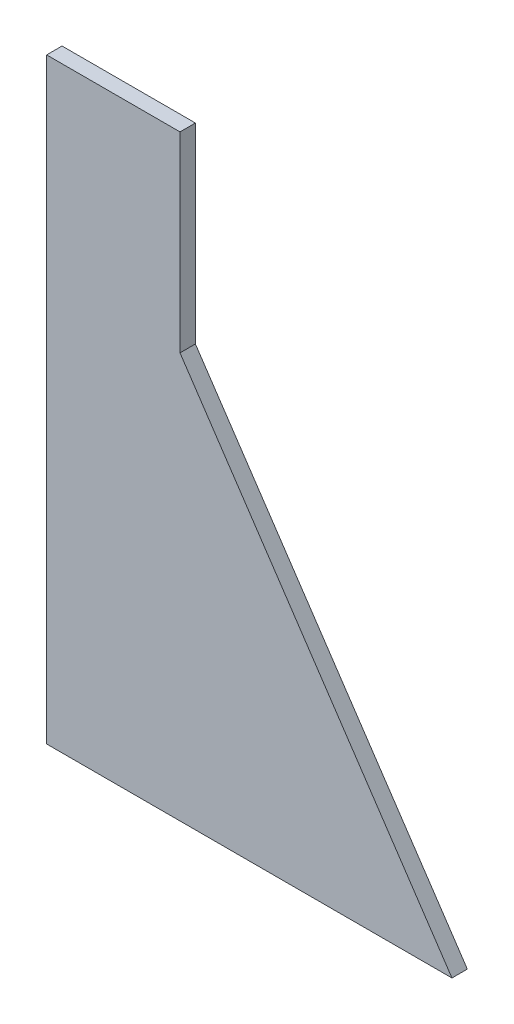
ISO-10303-21;
HEADER;
FILE_DESCRIPTION(('STEP AP214'),'2;1');
FILE_NAME('part.step','',(''),(''),'','','');
FILE_SCHEMA(('AUTOMOTIVE_DESIGN { 1 0 10303 214 1 1 1 1 }'));
ENDSEC;
DATA;
#1=APPLICATION_CONTEXT('core data for automotive mechanical design processes');
#2=APPLICATION_PROTOCOL_DEFINITION('international standard','automotive_design',2000,#1);
#3=PRODUCT_CONTEXT('',#1,'mechanical');
#4=PRODUCT('Part','Part','',(#3));
#5=PRODUCT_RELATED_PRODUCT_CATEGORY('part','',(#4));
#6=PRODUCT_DEFINITION_FORMATION('','',#4);
#7=PRODUCT_DEFINITION_CONTEXT('part definition',#1,'design');
#8=PRODUCT_DEFINITION('design','',#6,#7);
#9=PRODUCT_DEFINITION_SHAPE('','',#8);
#10=(LENGTH_UNIT() NAMED_UNIT(*) SI_UNIT(.MILLI.,.METRE.));
#11=(NAMED_UNIT(*) PLANE_ANGLE_UNIT() SI_UNIT($,.RADIAN.));
#12=(NAMED_UNIT(*) SI_UNIT($,.STERADIAN.) SOLID_ANGLE_UNIT());
#13=UNCERTAINTY_MEASURE_WITH_UNIT(LENGTH_MEASURE(1.E-05),#10,'distance_accuracy_value','');
#14=(GEOMETRIC_REPRESENTATION_CONTEXT(3) GLOBAL_UNCERTAINTY_ASSIGNED_CONTEXT((#13)) GLOBAL_UNIT_ASSIGNED_CONTEXT((#10,
#11,#12)) REPRESENTATION_CONTEXT('',''));
#15=CARTESIAN_POINT('',(0.,0.,0.));
#16=DIRECTION('',(0.,0.,1.));
#17=DIRECTION('',(1.,0.,0.));
#18=AXIS2_PLACEMENT_3D('',#15,#16,#17);
#19=CARTESIAN_POINT('',(0.,0.,-234.833966152866));
#20=DIRECTION('',(0.,1.,0.));
#21=DIRECTION('',(0.,0.,1.));
#22=AXIS2_PLACEMENT_3D('',#19,#20,#21);
#23=PLANE('',#22);
#24=DIRECTION('',(-1.,0.,0.));
#25=VECTOR('',#24,1.);
#26=CARTESIAN_POINT('',(0.,0.,-231.833966152866));
#27=LINE('',#26,#25);
#28=CARTESIAN_POINT('',(26.0000000000001,0.,-231.833966152866));
#29=VERTEX_POINT('',#28);
#30=CARTESIAN_POINT('',(0.,0.,-231.833966152866));
#31=VERTEX_POINT('',#30);
#32=EDGE_CURVE('E110',#29,#31,#27,.T.);
#33=ORIENTED_EDGE('',*,*,#32,.F.);
#34=DIRECTION('',(0.,0.,1.));
#35=VECTOR('',#34,1.);
#36=CARTESIAN_POINT('',(26.0000000000001,0.,-234.833966152866));
#37=LINE('',#36,#35);
#38=CARTESIAN_POINT('',(26.0000000000001,0.,-234.833966152866));
#39=VERTEX_POINT('',#38);
#40=EDGE_CURVE('E11',#39,#29,#37,.T.);
#41=ORIENTED_EDGE('',*,*,#40,.F.);
#42=DIRECTION('',(-1.,0.,0.));
#43=VECTOR('',#42,1.);
#44=CARTESIAN_POINT('',(0.,0.,-234.833966152866));
#45=LINE('',#44,#43);
#46=CARTESIAN_POINT('',(0.,0.,-234.833966152866));
#47=VERTEX_POINT('',#46);
#48=EDGE_CURVE('E105',#39,#47,#45,.T.);
#49=ORIENTED_EDGE('',*,*,#48,.T.);
#50=DIRECTION('',(0.,0.,1.));
#51=VECTOR('',#50,1.);
#52=CARTESIAN_POINT('',(0.,0.,-234.833966152866));
#53=LINE('',#52,#51);
#54=EDGE_CURVE('E36',#47,#31,#53,.T.);
#55=ORIENTED_EDGE('',*,*,#54,.T.);
#56=EDGE_LOOP('',(#33,#41,#49,#55));
#57=FACE_BOUND('',#56,.T.);
#58=ADVANCED_FACE('F33',(#57),#23,.T.);
#59=CARTESIAN_POINT('',(26.0000000000001,0.,-234.833966152866));
#60=DIRECTION('',(1.,0.,0.));
#61=DIRECTION('',(0.,1.,0.));
#62=AXIS2_PLACEMENT_3D('',#59,#60,#61);
#63=PLANE('',#62);
#64=DIRECTION('',(0.,1.,0.));
#65=VECTOR('',#64,1.);
#66=CARTESIAN_POINT('',(26.0000000000001,0.,-231.833966152866));
#67=LINE('',#66,#65);
#68=CARTESIAN_POINT('',(26.0000000000001,-37.3130535415794,-231.833966152866));
#69=VERTEX_POINT('',#68);
#70=EDGE_CURVE('E119',#69,#29,#67,.T.);
#71=ORIENTED_EDGE('',*,*,#70,.F.);
#72=DIRECTION('',(0.,0.,1.));
#73=VECTOR('',#72,1.);
#74=CARTESIAN_POINT('',(26.0000000000001,-37.3130535415794,-234.833966152866));
#75=LINE('',#74,#73);
#76=CARTESIAN_POINT('',(26.0000000000001,-37.3130535415794,-234.833966152866));
#77=VERTEX_POINT('',#76);
#78=EDGE_CURVE('E42',#77,#69,#75,.T.);
#79=ORIENTED_EDGE('',*,*,#78,.F.);
#80=DIRECTION('',(0.,1.,0.));
#81=VECTOR('',#80,1.);
#82=CARTESIAN_POINT('',(26.0000000000001,0.,-234.833966152866));
#83=LINE('',#82,#81);
#84=EDGE_CURVE('E100',#77,#39,#83,.T.);
#85=ORIENTED_EDGE('',*,*,#84,.T.);
#86=ORIENTED_EDGE('',*,*,#40,.T.);
#87=EDGE_LOOP('',(#71,#79,#85,#86));
#88=FACE_BOUND('',#87,.T.);
#89=ADVANCED_FACE('F125',(#88),#63,.T.);
#90=CARTESIAN_POINT('',(26.0000000000001,-37.3130535415794,-234.833966152866));
#91=DIRECTION('',(0.830468990469125,0.557064857865933,0.));
#92=DIRECTION('',(-0.557064857865933,0.830468990469125,0.));
#93=AXIS2_PLACEMENT_3D('',#90,#91,#92);
#94=PLANE('',#93);
#95=DIRECTION('',(-0.557064857865933,0.830468990469125,0.));
#96=VECTOR('',#95,1.);
#97=CARTESIAN_POINT('',(26.0000000000001,-37.3130535415794,-231.833966152866));
#98=LINE('',#97,#96);
#99=CARTESIAN_POINT('',(79.0188071685893,-116.353177224578,-231.833966152866));
#100=VERTEX_POINT('',#99);
#101=EDGE_CURVE('E89',#100,#69,#98,.T.);
#102=ORIENTED_EDGE('',*,*,#101,.F.);
#103=DIRECTION('',(0.,0.,1.));
#104=VECTOR('',#103,1.);
#105=CARTESIAN_POINT('',(79.0188071685893,-116.353177224578,-234.833966152866));
#106=LINE('',#105,#104);
#107=CARTESIAN_POINT('',(79.0188071685893,-116.353177224578,-234.833966152866));
#108=VERTEX_POINT('',#107);
#109=EDGE_CURVE('E84',#108,#100,#106,.T.);
#110=ORIENTED_EDGE('',*,*,#109,.F.);
#111=DIRECTION('',(-0.557064857865933,0.830468990469125,0.));
#112=VECTOR('',#111,1.);
#113=CARTESIAN_POINT('',(26.0000000000001,-37.3130535415794,-234.833966152866));
#114=LINE('',#113,#112);
#115=EDGE_CURVE('E87',#108,#77,#114,.T.);
#116=ORIENTED_EDGE('',*,*,#115,.T.);
#117=ORIENTED_EDGE('',*,*,#78,.T.);
#118=EDGE_LOOP('',(#102,#110,#116,#117));
#119=FACE_BOUND('',#118,.T.);
#120=ADVANCED_FACE('F86',(#119),#94,.T.);
#121=CARTESIAN_POINT('',(79.0188071685893,-116.353177224578,-234.833966152866));
#122=DIRECTION('',(0.,-1.,0.));
#123=DIRECTION('',(0.,0.,-1.));
#124=AXIS2_PLACEMENT_3D('',#121,#122,#123);
#125=PLANE('',#124);
#126=DIRECTION('',(1.,0.,0.));
#127=VECTOR('',#126,1.);
#128=CARTESIAN_POINT('',(79.0188071685893,-116.353177224578,-231.833966152866));
#129=LINE('',#128,#127);
#130=CARTESIAN_POINT('',(0.,-116.353177224578,-231.833966152866));
#131=VERTEX_POINT('',#130);
#132=EDGE_CURVE('E116',#131,#100,#129,.T.);
#133=ORIENTED_EDGE('',*,*,#132,.F.);
#134=DIRECTION('',(0.,0.,1.));
#135=VECTOR('',#134,1.);
#136=CARTESIAN_POINT('',(0.,-116.353177224578,-234.833966152866));
#137=LINE('',#136,#135);
#138=CARTESIAN_POINT('',(0.,-116.353177224578,-234.833966152866));
#139=VERTEX_POINT('',#138);
#140=EDGE_CURVE('E94',#139,#131,#137,.T.);
#141=ORIENTED_EDGE('',*,*,#140,.F.);
#142=DIRECTION('',(1.,0.,0.));
#143=VECTOR('',#142,1.);
#144=CARTESIAN_POINT('',(79.0188071685893,-116.353177224578,-234.833966152866));
#145=LINE('',#144,#143);
#146=EDGE_CURVE('E99',#139,#108,#145,.T.);
#147=ORIENTED_EDGE('',*,*,#146,.T.);
#148=ORIENTED_EDGE('',*,*,#109,.T.);
#149=EDGE_LOOP('',(#133,#141,#147,#148));
#150=FACE_BOUND('',#149,.T.);
#151=ADVANCED_FACE('F102',(#150),#125,.T.);
#152=CARTESIAN_POINT('',(0.,0.,-234.833966152866));
#153=DIRECTION('',(-1.,0.,0.));
#154=DIRECTION('',(0.,-1.,0.));
#155=AXIS2_PLACEMENT_3D('',#152,#153,#154);
#156=PLANE('',#155);
#157=DIRECTION('',(0.,-1.,0.));
#158=VECTOR('',#157,1.);
#159=CARTESIAN_POINT('',(0.,0.,-231.833966152866));
#160=LINE('',#159,#158);
#161=EDGE_CURVE('E113',#31,#131,#160,.T.);
#162=ORIENTED_EDGE('',*,*,#161,.F.);
#163=ORIENTED_EDGE('',*,*,#54,.F.);
#164=DIRECTION('',(0.,-1.,0.));
#165=VECTOR('',#164,1.);
#166=CARTESIAN_POINT('',(0.,0.,-234.833966152866));
#167=LINE('',#166,#165);
#168=EDGE_CURVE('E103',#47,#139,#167,.T.);
#169=ORIENTED_EDGE('',*,*,#168,.T.);
#170=ORIENTED_EDGE('',*,*,#140,.T.);
#171=EDGE_LOOP('',(#162,#163,#169,#170));
#172=FACE_BOUND('',#171,.T.);
#173=ADVANCED_FACE('F122',(#172),#156,.T.);
#174=CARTESIAN_POINT('',(0.,0.,-234.833966152866));
#175=DIRECTION('',(0.,0.,-1.));
#176=DIRECTION('',(-1.,0.,0.));
#177=AXIS2_PLACEMENT_3D('',#174,#175,#176);
#178=PLANE('',#177);
#179=ORIENTED_EDGE('',*,*,#48,.F.);
#180=ORIENTED_EDGE('',*,*,#84,.F.);
#181=ORIENTED_EDGE('',*,*,#115,.F.);
#182=ORIENTED_EDGE('',*,*,#146,.F.);
#183=ORIENTED_EDGE('',*,*,#168,.F.);
#184=EDGE_LOOP('',(#179,#180,#181,#182,#183));
#185=FACE_BOUND('',#184,.T.);
#186=ADVANCED_FACE('F98',(#185),#178,.T.);
#187=CARTESIAN_POINT('',(0.,0.,-231.833966152866));
#188=DIRECTION('',(0.,0.,-1.));
#189=DIRECTION('',(-1.,0.,0.));
#190=AXIS2_PLACEMENT_3D('',#187,#188,#189);
#191=PLANE('',#190);
#192=ORIENTED_EDGE('',*,*,#32,.T.);
#193=ORIENTED_EDGE('',*,*,#161,.T.);
#194=ORIENTED_EDGE('',*,*,#132,.T.);
#195=ORIENTED_EDGE('',*,*,#101,.T.);
#196=ORIENTED_EDGE('',*,*,#70,.T.);
#197=EDGE_LOOP('',(#192,#193,#194,#195,#196));
#198=FACE_BOUND('',#197,.T.);
#199=ADVANCED_FACE('F124',(#198),#191,.F.);
#200=CLOSED_SHELL('',(#58,#89,#120,#151,#173,#186,#199));
#201=MANIFOLD_SOLID_BREP('B2',#200);
#202=ADVANCED_BREP_SHAPE_REPRESENTATION('',(#18,#201),#14);
#203=SHAPE_DEFINITION_REPRESENTATION(#9,#202);
ENDSEC;
END-ISO-10303-21;
